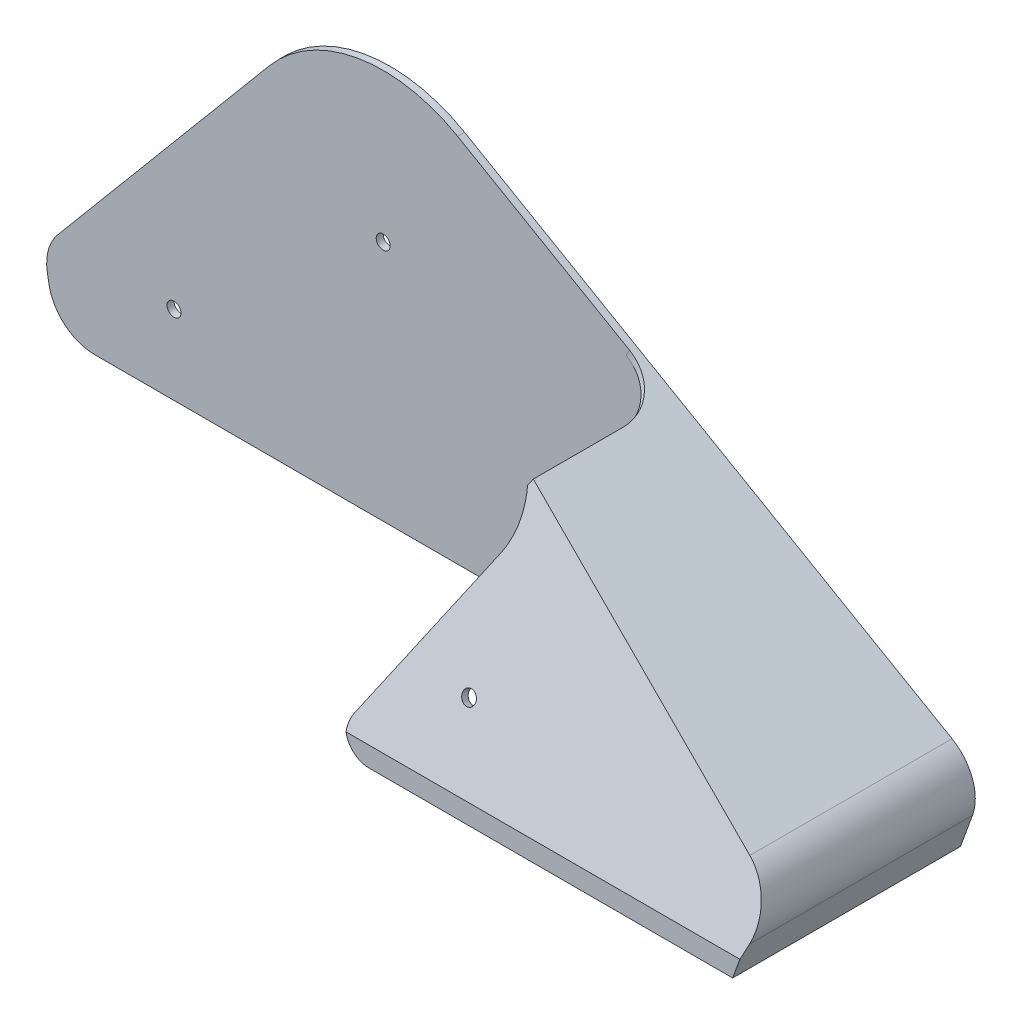
ISO-10303-21;
HEADER;
FILE_DESCRIPTION(('STEP AP214'),'2;1');
FILE_NAME('part.step','',(''),(''),'','','');
FILE_SCHEMA(('AUTOMOTIVE_DESIGN { 1 0 10303 214 1 1 1 1 }'));
ENDSEC;
DATA;
#1=APPLICATION_CONTEXT('core data for automotive mechanical design processes');
#2=APPLICATION_PROTOCOL_DEFINITION('international standard','automotive_design',2000,#1);
#3=PRODUCT_CONTEXT('',#1,'mechanical');
#4=PRODUCT('Part','Part','',(#3));
#5=PRODUCT_RELATED_PRODUCT_CATEGORY('part','',(#4));
#6=PRODUCT_DEFINITION_FORMATION('','',#4);
#7=PRODUCT_DEFINITION_CONTEXT('part definition',#1,'design');
#8=PRODUCT_DEFINITION('design','',#6,#7);
#9=PRODUCT_DEFINITION_SHAPE('','',#8);
#10=(LENGTH_UNIT() NAMED_UNIT(*) SI_UNIT(.MILLI.,.METRE.));
#11=(NAMED_UNIT(*) PLANE_ANGLE_UNIT() SI_UNIT($,.RADIAN.));
#12=(NAMED_UNIT(*) SI_UNIT($,.STERADIAN.) SOLID_ANGLE_UNIT());
#13=UNCERTAINTY_MEASURE_WITH_UNIT(LENGTH_MEASURE(1.E-05),#10,'distance_accuracy_value','');
#14=(GEOMETRIC_REPRESENTATION_CONTEXT(3) GLOBAL_UNCERTAINTY_ASSIGNED_CONTEXT((#13)) GLOBAL_UNIT_ASSIGNED_CONTEXT((#10,
#11,#12)) REPRESENTATION_CONTEXT('',''));
#15=CARTESIAN_POINT('',(0.,0.,0.));
#16=DIRECTION('',(0.,0.,1.));
#17=DIRECTION('',(1.,0.,0.));
#18=AXIS2_PLACEMENT_3D('',#15,#16,#17);
#19=CARTESIAN_POINT('',(-41.9752973417695,-243.681845607916,46.));
#20=DIRECTION('',(0.,1.,0.));
#21=DIRECTION('',(0.,0.,1.));
#22=AXIS2_PLACEMENT_3D('',#19,#20,#21);
#23=PLANE('',#22);
#24=DIRECTION('',(1.,0.,0.));
#25=VECTOR('',#24,1.);
#26=CARTESIAN_POINT('',(-41.9752973417695,-243.681845607916,47.5));
#27=LINE('',#26,#25);
#28=CARTESIAN_POINT('',(-118.598691665262,-243.681845607916,47.5));
#29=VERTEX_POINT('',#28);
#30=CARTESIAN_POINT('',(-40.3790306830556,-243.681845607916,47.5));
#31=VERTEX_POINT('',#30);
#32=EDGE_CURVE('E212',#29,#31,#27,.T.);
#33=ORIENTED_EDGE('',*,*,#32,.F.);
#34=DIRECTION('',(0.,0.,-1.));
#35=VECTOR('',#34,1.);
#36=CARTESIAN_POINT('',(-118.598691665262,-243.681845607916,46.));
#37=LINE('',#36,#35);
#38=CARTESIAN_POINT('',(-118.598691665262,-243.681845607916,46.));
#39=VERTEX_POINT('',#38);
#40=EDGE_CURVE('E269',#29,#39,#37,.T.);
#41=ORIENTED_EDGE('',*,*,#40,.T.);
#42=DIRECTION('',(1.,0.,0.));
#43=VECTOR('',#42,1.);
#44=CARTESIAN_POINT('',(-41.9752973417695,-243.681845607916,46.));
#45=LINE('',#44,#43);
#46=CARTESIAN_POINT('',(-41.9752973417695,-243.681845607916,46.));
#47=VERTEX_POINT('',#46);
#48=EDGE_CURVE('E322',#39,#47,#45,.T.);
#49=ORIENTED_EDGE('',*,*,#48,.T.);
#50=DIRECTION('',(0.,0.,-1.));
#51=VECTOR('',#50,1.);
#52=CARTESIAN_POINT('',(-41.9752973417695,-243.681845607916,46.));
#53=LINE('',#52,#51);
#54=CARTESIAN_POINT('',(-41.9752973417695,-243.681845607916,0.));
#55=VERTEX_POINT('',#54);
#56=EDGE_CURVE('E200',#47,#55,#53,.T.);
#57=ORIENTED_EDGE('',*,*,#56,.T.);
#58=DIRECTION('',(1.,0.,0.));
#59=VECTOR('',#58,1.);
#60=CARTESIAN_POINT('',(-41.9752973417695,-243.681845607916,0.));
#61=LINE('',#60,#59);
#62=CARTESIAN_POINT('',(-225.107440947825,-243.681845607916,0.));
#63=VERTEX_POINT('',#62);
#64=EDGE_CURVE('E312',#63,#55,#61,.T.);
#65=ORIENTED_EDGE('',*,*,#64,.F.);
#66=DIRECTION('',(0.,0.,-1.));
#67=VECTOR('',#66,1.);
#68=CARTESIAN_POINT('',(-225.107440947825,-243.681845607916,46.));
#69=LINE('',#68,#67);
#70=CARTESIAN_POINT('',(-225.107440947825,-243.681845607916,-1.5));
#71=VERTEX_POINT('',#70);
#72=EDGE_CURVE('E251',#63,#71,#69,.T.);
#73=ORIENTED_EDGE('',*,*,#72,.T.);
#74=DIRECTION('',(1.,0.,0.));
#75=VECTOR('',#74,1.);
#76=CARTESIAN_POINT('',(-41.9752973417695,-243.681845607916,-1.5));
#77=LINE('',#76,#75);
#78=CARTESIAN_POINT('',(-40.3790306830556,-243.681845607916,-1.5));
#79=VERTEX_POINT('',#78);
#80=EDGE_CURVE('E217',#71,#79,#77,.T.);
#81=ORIENTED_EDGE('',*,*,#80,.T.);
#82=DIRECTION('',(0.,0.,-1.));
#83=VECTOR('',#82,1.);
#84=CARTESIAN_POINT('',(-40.3790306830556,-243.681845607916,46.));
#85=LINE('',#84,#83);
#86=EDGE_CURVE('E222',#31,#79,#85,.T.);
#87=ORIENTED_EDGE('',*,*,#86,.F.);
#88=EDGE_LOOP('',(#33,#41,#49,#57,#65,#73,#81,#87));
#89=FACE_BOUND('',#88,.T.);
#90=ADVANCED_FACE('F38',(#89),#23,.F.);
#91=CARTESIAN_POINT('',(-163.054662392863,-191.681845607916,47.5));
#92=DIRECTION('',(0.,0.,1.));
#93=DIRECTION('',(1.,0.,0.));
#94=AXIS2_PLACEMENT_3D('',#91,#92,#93);
#95=PLANE('',#94);
#96=DIRECTION('',(-1.,0.,0.));
#97=VECTOR('',#96,1.);
#98=CARTESIAN_POINT('',(-163.054662392863,-239.413539783714,47.5));
#99=LINE('',#98,#97);
#100=CARTESIAN_POINT('',(-38.825494412301,-239.413539783714,47.5));
#101=VERTEX_POINT('',#100);
#102=CARTESIAN_POINT('',(-123.544864289939,-239.413539783714,47.5));
#103=VERTEX_POINT('',#102);
#104=EDGE_CURVE('E202',#101,#103,#99,.T.);
#105=ORIENTED_EDGE('',*,*,#104,.T.);
#106=CARTESIAN_POINT('',(-118.598691665262,-238.681845607916,47.5));
#107=DIRECTION('',(0.,0.,1.));
#108=DIRECTION('',(1.,0.,0.));
#109=AXIS2_PLACEMENT_3D('',#106,#107,#108);
#110=CIRCLE('',#109,5.);
#111=EDGE_CURVE('E280',#103,#29,#110,.T.);
#112=ORIENTED_EDGE('',*,*,#111,.T.);
#113=ORIENTED_EDGE('',*,*,#32,.T.);
#114=DIRECTION('',(0.342020143325666,0.939692620785909,0.));
#115=VECTOR('',#114,1.);
#116=CARTESIAN_POINT('',(-35.358522416334,-229.888112510913,47.5));
#117=LINE('',#116,#115);
#118=EDGE_CURVE('E219',#31,#101,#117,.T.);
#119=ORIENTED_EDGE('',*,*,#118,.T.);
#120=EDGE_LOOP('',(#105,#112,#113,#119));
#121=FACE_BOUND('',#120,.T.);
#122=ADVANCED_FACE('F429',(#121),#95,.T.);
#123=CARTESIAN_POINT('',(-163.054662392863,-191.681845607916,46.));
#124=DIRECTION('',(0.,0.,-1.));
#125=DIRECTION('',(-1.,0.,0.));
#126=AXIS2_PLACEMENT_3D('',#123,#124,#125);
#127=CYLINDRICAL_SURFACE('',#126,32.);
#128=CARTESIAN_POINT('',(-163.054662392863,-191.681845607916,0.));
#129=DIRECTION('',(0.,0.,1.));
#130=DIRECTION('',(1.,0.,0.));
#131=AXIS2_PLACEMENT_3D('',#128,#129,#130);
#132=CIRCLE('',#131,32.);
#133=CARTESIAN_POINT('',(-147.054662392863,-163.969032686814,0.));
#134=VERTEX_POINT('',#133);
#135=CARTESIAN_POINT('',(-187.56808457267,-171.112642097946,0.));
#136=VERTEX_POINT('',#135);
#137=EDGE_CURVE('E346',#134,#136,#132,.T.);
#138=ORIENTED_EDGE('',*,*,#137,.F.);
#139=DIRECTION('',(0.,0.,-1.));
#140=VECTOR('',#139,1.);
#141=CARTESIAN_POINT('',(-147.054662392863,-163.969032686814,46.));
#142=LINE('',#141,#140);
#143=CARTESIAN_POINT('',(-147.054662392863,-163.969032686814,-1.5));
#144=VERTEX_POINT('',#143);
#145=EDGE_CURVE('E226',#134,#144,#142,.T.);
#146=ORIENTED_EDGE('',*,*,#145,.T.);
#147=CARTESIAN_POINT('',(-163.054662392863,-191.681845607916,-1.5));
#148=DIRECTION('',(0.,0.,1.));
#149=DIRECTION('',(1.,0.,0.));
#150=AXIS2_PLACEMENT_3D('',#147,#148,#149);
#151=CIRCLE('',#150,32.);
#152=CARTESIAN_POINT('',(-187.56808457267,-171.112642097946,-1.5));
#153=VERTEX_POINT('',#152);
#154=EDGE_CURVE('E209',#144,#153,#151,.T.);
#155=ORIENTED_EDGE('',*,*,#154,.T.);
#156=DIRECTION('',(0.,0.,1.));
#157=VECTOR('',#156,1.);
#158=CARTESIAN_POINT('',(-187.56808457267,-171.112642097946,46.));
#159=LINE('',#158,#157);
#160=EDGE_CURVE('E225',#136,#153,#159,.F.);
#161=ORIENTED_EDGE('',*,*,#160,.F.);
#162=EDGE_LOOP('',(#138,#146,#155,#161));
#163=FACE_BOUND('',#162,.T.);
#164=ADVANCED_FACE('F344',(#163),#127,.T.);
#165=CARTESIAN_POINT('',(-187.56808457267,-171.112642097946,46.));
#166=DIRECTION('',(0.766044443118977,-0.642787609686541,0.));
#167=DIRECTION('',(0.642787609686541,0.766044443118977,0.));
#168=AXIS2_PLACEMENT_3D('',#165,#166,#167);
#169=PLANE('',#168);
#170=DIRECTION('',(-0.642787609686541,-0.766044443118977,0.));
#171=VECTOR('',#170,1.);
#172=CARTESIAN_POINT('',(-187.56808457267,-171.112642097946,-1.5));
#173=LINE('',#172,#171);
#174=CARTESIAN_POINT('',(-233.099269712768,-225.37459556373,-1.5));
#175=VERTEX_POINT('',#174);
#176=EDGE_CURVE('E335',#153,#175,#173,.T.);
#177=ORIENTED_EDGE('',*,*,#176,.T.);
#178=DIRECTION('',(0.,0.,-1.));
#179=VECTOR('',#178,1.);
#180=CARTESIAN_POINT('',(-233.099269712768,-225.37459556373,46.));
#181=LINE('',#180,#179);
#182=CARTESIAN_POINT('',(-233.099269712768,-225.37459556373,0.));
#183=VERTEX_POINT('',#182);
#184=EDGE_CURVE('E267',#175,#183,#181,.F.);
#185=ORIENTED_EDGE('',*,*,#184,.T.);
#186=DIRECTION('',(-0.642787609686541,-0.766044443118977,0.));
#187=VECTOR('',#186,1.);
#188=CARTESIAN_POINT('',(-187.56808457267,-171.112642097946,0.));
#189=LINE('',#188,#187);
#190=EDGE_CURVE('E367',#136,#183,#189,.T.);
#191=ORIENTED_EDGE('',*,*,#190,.F.);
#192=ORIENTED_EDGE('',*,*,#160,.T.);
#193=EDGE_LOOP('',(#177,#185,#191,#192));
#194=FACE_BOUND('',#193,.T.);
#195=ADVANCED_FACE('F356',(#194),#169,.F.);
#196=CARTESIAN_POINT('',(-233.452508971288,-243.942317874416,46.));
#197=DIRECTION('',(0.984807753012209,0.173648177666926,0.));
#198=DIRECTION('',(-0.173648177666926,0.984807753012209,0.));
#199=AXIS2_PLACEMENT_3D('',#196,#197,#198);
#200=PLANE('',#199);
#201=DIRECTION('',(0.173648177666926,-0.984807753012209,0.));
#202=VECTOR('',#201,1.);
#203=CARTESIAN_POINT('',(-233.452508971288,-243.942317874416,-1.5));
#204=LINE('',#203,#202);
#205=CARTESIAN_POINT('',(-235.286902811701,-233.538953437264,-1.5));
#206=VERTEX_POINT('',#205);
#207=CARTESIAN_POINT('',(-234.955518477947,-235.418327384585,-1.5));
#208=VERTEX_POINT('',#207);
#209=EDGE_CURVE('E221',#206,#208,#204,.T.);
#210=ORIENTED_EDGE('',*,*,#209,.T.);
#211=DIRECTION('',(0.,0.,-1.));
#212=VECTOR('',#211,1.);
#213=CARTESIAN_POINT('',(-234.955518477947,-235.418327384585,46.));
#214=LINE('',#213,#212);
#215=CARTESIAN_POINT('',(-234.955518477947,-235.418327384585,0.));
#216=VERTEX_POINT('',#215);
#217=EDGE_CURVE('E261',#208,#216,#214,.F.);
#218=ORIENTED_EDGE('',*,*,#217,.T.);
#219=DIRECTION('',(0.173648177666927,-0.984807753012209,0.));
#220=VECTOR('',#219,1.);
#221=CARTESIAN_POINT('',(-240.266821263985,-205.296432455643,0.));
#222=LINE('',#221,#220);
#223=CARTESIAN_POINT('',(-235.286902811701,-233.538953437264,0.));
#224=VERTEX_POINT('',#223);
#225=EDGE_CURVE('E365',#224,#216,#222,.T.);
#226=ORIENTED_EDGE('',*,*,#225,.F.);
#227=DIRECTION('',(0.,0.,-1.));
#228=VECTOR('',#227,1.);
#229=CARTESIAN_POINT('',(-235.286902811701,-233.538953437264,46.));
#230=LINE('',#229,#228);
#231=EDGE_CURVE('E258',#224,#206,#230,.T.);
#232=ORIENTED_EDGE('',*,*,#231,.T.);
#233=EDGE_LOOP('',(#210,#218,#226,#232));
#234=FACE_BOUND('',#233,.T.);
#235=ADVANCED_FACE('F369',(#234),#200,.F.);
#236=CARTESIAN_POINT('',(-147.054662392863,-163.969032686814,46.));
#237=DIRECTION('',(-0.499999999999998,-0.86602540378444,0.));
#238=DIRECTION('',(0.86602540378444,-0.499999999999998,0.));
#239=AXIS2_PLACEMENT_3D('',#236,#237,#238);
#240=PLANE('',#239);
#241=DIRECTION('',(-0.86602540378444,0.499999999999998,0.));
#242=VECTOR('',#241,1.);
#243=CARTESIAN_POINT('',(-147.054662392863,-163.969032686814,0.));
#244=LINE('',#243,#242);
#245=CARTESIAN_POINT('',(-110.064861814121,-185.325104008221,0.));
#246=VERTEX_POINT('',#245);
#247=EDGE_CURVE('E186',#246,#134,#244,.T.);
#248=ORIENTED_EDGE('',*,*,#247,.F.);
#249=CARTESIAN_POINT('',(-110.064861814121,-185.325104008221,10.));
#250=DIRECTION('',(-0.499999999999998,-0.86602540378444,0.));
#251=DIRECTION('',(0.86602540378444,-0.499999999999998,0.));
#252=AXIS2_PLACEMENT_3D('',#249,#250,#251);
#253=CIRCLE('',#252,10.);
#254=CARTESIAN_POINT('',(-101.404607776277,-190.325104008221,10.));
#255=VERTEX_POINT('',#254);
#256=EDGE_CURVE('E47',#246,#255,#253,.T.);
#257=ORIENTED_EDGE('',*,*,#256,.T.);
#258=DIRECTION('',(0.,0.,-1.));
#259=VECTOR('',#258,1.);
#260=CARTESIAN_POINT('',(-101.404607776277,-190.325104008221,34.8107421787631));
#261=LINE('',#260,#259);
#262=CARTESIAN_POINT('',(-101.404607776277,-190.325104008221,29.3586215612309));
#263=VERTEX_POINT('',#262);
#264=EDGE_CURVE('E180',#263,#255,#261,.T.);
#265=ORIENTED_EDGE('',*,*,#264,.F.);
#266=DIRECTION('',(-0.851608514271017,0.491676404958546,-0.18170649748468));
#267=VECTOR('',#266,1.);
#268=CARTESIAN_POINT('',(-142.972289569604,-166.325991735255,20.4893844168738));
#269=LINE('',#268,#267);
#270=CARTESIAN_POINT('',(-42.1948549212111,-224.509870757744,41.9921223164894));
#271=VERTEX_POINT('',#270);
#272=EDGE_CURVE('E191',#271,#263,#269,.T.);
#273=ORIENTED_EDGE('',*,*,#272,.F.);
#274=DIRECTION('',(0.,0.,-1.));
#275=VECTOR('',#274,1.);
#276=CARTESIAN_POINT('',(-42.1948549212111,-224.509870757744,46.));
#277=LINE('',#276,#275);
#278=CARTESIAN_POINT('',(-42.1948549212111,-224.509870757744,-1.5));
#279=VERTEX_POINT('',#278);
#280=EDGE_CURVE('E244',#271,#279,#277,.T.);
#281=ORIENTED_EDGE('',*,*,#280,.T.);
#282=DIRECTION('',(-0.86602540378444,0.499999999999998,0.));
#283=VECTOR('',#282,1.);
#284=CARTESIAN_POINT('',(-147.054662392863,-163.969032686814,-1.5));
#285=LINE('',#284,#283);
#286=EDGE_CURVE('E211',#279,#144,#285,.T.);
#287=ORIENTED_EDGE('',*,*,#286,.T.);
#288=ORIENTED_EDGE('',*,*,#145,.F.);
#289=EDGE_LOOP('',(#248,#257,#265,#273,#281,#287,#288));
#290=FACE_BOUND('',#289,.T.);
#291=ADVANCED_FACE('F189',(#290),#240,.F.);
#292=CARTESIAN_POINT('',(0.,-13.3245376288953,-36.0546312311286));
#293=DIRECTION('',(0.,0.346650140871629,0.937994498829113));
#294=DIRECTION('',(0.,-0.937994498829113,0.346650140871629));
#295=AXIS2_PLACEMENT_3D('',#292,#293,#294);
#296=PLANE('',#295);
#297=CARTESIAN_POINT('',(-102.379030683056,-225.091952914172,42.2072396351692));
#298=DIRECTION('',(0.,0.346650140871629,0.937994498829113));
#299=DIRECTION('',(0.,-0.937994498829113,0.346650140871629));
#300=AXIS2_PLACEMENT_3D('',#297,#298,#299);
#301=CIRCLE('',#300,1.5);
#302=CARTESIAN_POINT('',(-102.379030683056,-226.498944662415,42.7272148464767));
#303=VERTEX_POINT('',#302);
#304=EDGE_CURVE('E412',#303,#303,#301,.T.);
#305=ORIENTED_EDGE('',*,*,#304,.F.);
#306=EDGE_LOOP('',(#305));
#307=FACE_BOUND('',#306,.T.);
#308=DIRECTION('',(0.476204765262695,0.824810848241403,-0.304821400437041));
#309=VECTOR('',#308,1.);
#310=CARTESIAN_POINT('',(0.608312315265829,-13.6335433812033,-35.9404334531017));
#311=LINE('',#310,#309);
#312=CARTESIAN_POINT('',(-102.154607776277,-191.624142113897,29.8387008611548));
#313=VERTEX_POINT('',#312);
#314=EDGE_CURVE('E178',#313,#263,#311,.T.);
#315=ORIENTED_EDGE('',*,*,#314,.F.);
#316=CARTESIAN_POINT('',(-116.681595433917,-195.361337532227,31.2198382983636));
#317=DIRECTION('',(0.,0.346650140871629,0.937994498829113));
#318=DIRECTION('',(0.,0.937994498829113,-0.346650140871629));
#319=AXIS2_PLACEMENT_3D('',#316,#317,#318);
#320=ELLIPSE('',#319,15.9915650024859,15.);
#321=CARTESIAN_POINT('',(-103.69121437715,-202.861337532227,33.9915774287983));
#322=VERTEX_POINT('',#321);
#323=EDGE_CURVE('E380',#313,#322,#320,.F.);
#324=ORIENTED_EDGE('',*,*,#323,.T.);
#325=DIRECTION('',(-0.476204765262695,-0.824810848241403,0.304821400437041));
#326=VECTOR('',#325,1.);
#327=CARTESIAN_POINT('',(4.4367170414046,-15.5782665979658,-35.221731394733));
#328=LINE('',#327,#326);
#329=CARTESIAN_POINT('',(-122.928818684184,-236.181845607916,46.305678239379));
#330=VERTEX_POINT('',#329);
#331=EDGE_CURVE('E382',#322,#330,#328,.T.);
#332=ORIENTED_EDGE('',*,*,#331,.T.);
#333=CARTESIAN_POINT('',(-118.598691665262,-238.681845607916,47.2295912828573));
#334=DIRECTION('',(0.,0.346650140871629,0.937994498829113));
#335=DIRECTION('',(0.,-0.937994498829113,0.346650140871629));
#336=AXIS2_PLACEMENT_3D('',#333,#334,#335);
#337=ELLIPSE('',#336,5.33052166749532,5.);
#338=EDGE_CURVE('E278',#330,#103,#337,.T.);
#339=ORIENTED_EDGE('',*,*,#338,.T.);
#340=ORIENTED_EDGE('',*,*,#104,.F.);
#341=DIRECTION('',(0.323091866740261,0.887687608278315,-0.328058463928943));
#342=VECTOR('',#341,1.);
#343=CARTESIAN_POINT('',(-35.5726565776119,-230.476441283757,44.1971592500162));
#344=LINE('',#343,#342);
#345=CARTESIAN_POINT('',(-37.797928713352,-236.590326228845,46.4566384688529));
#346=VERTEX_POINT('',#345);
#347=EDGE_CURVE('E199',#101,#346,#344,.T.);
#348=ORIENTED_EDGE('',*,*,#347,.T.);
#349=CARTESIAN_POINT('',(-47.1948549212111,-233.170124795588,45.1926509826494));
#350=DIRECTION('',(0.,0.346650140871629,0.937994498829113));
#351=DIRECTION('',(0.,0.937994498829113,-0.346650140871629));
#352=AXIS2_PLACEMENT_3D('',#349,#350,#351);
#353=ELLIPSE('',#352,10.6610433349906,10.);
#354=EDGE_CURVE('E198',#346,#271,#353,.T.);
#355=ORIENTED_EDGE('',*,*,#354,.T.);
#356=ORIENTED_EDGE('',*,*,#272,.T.);
#357=EDGE_LOOP('',(#315,#324,#332,#339,#340,#348,#355,#356));
#358=FACE_BOUND('',#357,.T.);
#359=ADVANCED_FACE('F195',(#307,#358),#296,.T.);
#360=CARTESIAN_POINT('',(-163.054662392863,-191.681845607916,46.));
#361=DIRECTION('',(0.,0.,1.));
#362=DIRECTION('',(1.,0.,0.));
#363=AXIS2_PLACEMENT_3D('',#360,#361,#362);
#364=PLANE('',#363);
#365=ORIENTED_EDGE('',*,*,#48,.F.);
#366=CARTESIAN_POINT('',(-118.598691665262,-238.681845607916,46.));
#367=DIRECTION('',(0.,0.,1.));
#368=DIRECTION('',(1.,0.,0.));
#369=AXIS2_PLACEMENT_3D('',#366,#367,#368);
#370=CIRCLE('',#369,5.);
#371=CARTESIAN_POINT('',(-123.497671150828,-239.681845607916,46.));
#372=VERTEX_POINT('',#371);
#373=EDGE_CURVE('E272',#39,#372,#370,.F.);
#374=ORIENTED_EDGE('',*,*,#373,.T.);
#375=DIRECTION('',(-1.,0.,0.));
#376=VECTOR('',#375,1.);
#377=CARTESIAN_POINT('',(-163.054662392863,-239.681845607916,46.));
#378=LINE('',#377,#376);
#379=CARTESIAN_POINT('',(-40.5194164047047,-239.681845607916,46.));
#380=VERTEX_POINT('',#379);
#381=EDGE_CURVE('E313',#380,#372,#378,.T.);
#382=ORIENTED_EDGE('',*,*,#381,.F.);
#383=DIRECTION('',(0.342020143325666,0.939692620785909,0.));
#384=VECTOR('',#383,1.);
#385=CARTESIAN_POINT('',(-36.7680613475128,-229.375082295924,46.));
#386=LINE('',#385,#384);
#387=EDGE_CURVE('E205',#47,#380,#386,.T.);
#388=ORIENTED_EDGE('',*,*,#387,.F.);
#389=EDGE_LOOP('',(#365,#374,#382,#388));
#390=FACE_BOUND('',#389,.T.);
#391=ADVANCED_FACE('F459',(#390),#364,.F.);
#392=CARTESIAN_POINT('',(-147.804662392863,-165.26807079249,46.));
#393=DIRECTION('',(-0.499999999999998,-0.86602540378444,0.));
#394=DIRECTION('',(0.86602540378444,-0.499999999999998,0.));
#395=AXIS2_PLACEMENT_3D('',#392,#393,#394);
#396=PLANE('',#395);
#397=DIRECTION('',(-0.86602540378444,0.499999999999998,0.));
#398=VECTOR('',#397,1.);
#399=CARTESIAN_POINT('',(-147.804662392863,-165.26807079249,0.));
#400=LINE('',#399,#398);
#401=CARTESIAN_POINT('',(-44.0348773165696,-225.179584140038,0.));
#402=VERTEX_POINT('',#401);
#403=CARTESIAN_POINT('',(-110.814861814121,-186.624142113897,0.));
#404=VERTEX_POINT('',#403);
#405=EDGE_CURVE('E307',#402,#404,#400,.T.);
#406=ORIENTED_EDGE('',*,*,#405,.F.);
#407=DIRECTION('',(0.,0.,-1.));
#408=VECTOR('',#407,1.);
#409=CARTESIAN_POINT('',(-44.0348773165696,-225.179584140038,42.1909787760031));
#410=LINE('',#409,#408);
#411=CARTESIAN_POINT('',(-44.0348773165697,-225.179584140038,40.6404685879581));
#412=VERTEX_POINT('',#411);
#413=EDGE_CURVE('E240',#402,#412,#410,.F.);
#414=ORIENTED_EDGE('',*,*,#413,.T.);
#415=DIRECTION('',(-0.851608514271017,0.491676404958546,-0.18170649748468));
#416=VECTOR('',#415,1.);
#417=CARTESIAN_POINT('',(-143.549120429811,-167.725009090406,19.407256069616));
#418=LINE('',#417,#416);
#419=CARTESIAN_POINT('',(-102.154607776277,-191.624142113897,28.2395443609062));
#420=VERTEX_POINT('',#419);
#421=EDGE_CURVE('E385',#412,#420,#418,.T.);
#422=ORIENTED_EDGE('',*,*,#421,.T.);
#423=DIRECTION('',(0.,0.,-1.));
#424=VECTOR('',#423,1.);
#425=CARTESIAN_POINT('',(-102.154607776277,-191.624142113897,47.5));
#426=LINE('',#425,#424);
#427=CARTESIAN_POINT('',(-102.154607776277,-191.624142113897,10.));
#428=VERTEX_POINT('',#427);
#429=EDGE_CURVE('E374',#420,#428,#426,.T.);
#430=ORIENTED_EDGE('',*,*,#429,.T.);
#431=CARTESIAN_POINT('',(-110.814861814121,-186.624142113897,10.));
#432=DIRECTION('',(-0.499999999999998,-0.86602540378444,0.));
#433=DIRECTION('',(0.86602540378444,-0.499999999999998,0.));
#434=AXIS2_PLACEMENT_3D('',#431,#432,#433);
#435=CIRCLE('',#434,10.);
#436=EDGE_CURVE('E11',#428,#404,#435,.F.);
#437=ORIENTED_EDGE('',*,*,#436,.T.);
#438=EDGE_LOOP('',(#406,#414,#422,#430,#437));
#439=FACE_BOUND('',#438,.T.);
#440=ADVANCED_FACE('F400',(#439),#396,.T.);
#441=CARTESIAN_POINT('',(-163.054662392863,-191.681845607916,46.));
#442=DIRECTION('',(0.,0.,-1.));
#443=DIRECTION('',(-1.,0.,0.));
#444=AXIS2_PLACEMENT_3D('',#441,#442,#443);
#445=CYLINDRICAL_SURFACE('',#444,1.5);
#446=CARTESIAN_POINT('',(-163.054662392863,-191.681845607916,-1.5));
#447=DIRECTION('',(0.,0.,1.));
#448=DIRECTION('',(1.,0.,0.));
#449=AXIS2_PLACEMENT_3D('',#446,#447,#448);
#450=CIRCLE('',#449,1.5);
#451=CARTESIAN_POINT('',(-161.554662392863,-191.681845607916,-1.5));
#452=VERTEX_POINT('',#451);
#453=EDGE_CURVE('E227',#452,#452,#450,.T.);
#454=ORIENTED_EDGE('',*,*,#453,.F.);
#455=EDGE_LOOP('',(#454));
#456=FACE_BOUND('',#455,.T.);
#457=CARTESIAN_POINT('',(-163.054662392863,-191.681845607916,0.));
#458=DIRECTION('',(0.,0.,1.));
#459=DIRECTION('',(1.,0.,0.));
#460=AXIS2_PLACEMENT_3D('',#457,#458,#459);
#461=CIRCLE('',#460,1.5);
#462=CARTESIAN_POINT('',(-161.554662392863,-191.681845607916,0.));
#463=VERTEX_POINT('',#462);
#464=EDGE_CURVE('E310',#463,#463,#461,.T.);
#465=ORIENTED_EDGE('',*,*,#464,.T.);
#466=EDGE_LOOP('',(#465));
#467=FACE_BOUND('',#466,.T.);
#468=ADVANCED_FACE('F439',(#456,#467),#445,.F.);
#469=CARTESIAN_POINT('',(-35.358522416334,-229.888112510913,46.));
#470=DIRECTION('',(-0.939692620785909,0.342020143325666,0.));
#471=DIRECTION('',(-0.342020143325666,-0.939692620785909,0.));
#472=AXIS2_PLACEMENT_3D('',#469,#470,#471);
#473=PLANE('',#472);
#474=DIRECTION('',(0.342020143325666,0.939692620785909,0.));
#475=VECTOR('',#474,1.);
#476=CARTESIAN_POINT('',(-35.358522416334,-229.888112510913,-1.5));
#477=LINE('',#476,#475);
#478=CARTESIAN_POINT('',(-37.797928713352,-236.590326228845,-1.5));
#479=VERTEX_POINT('',#478);
#480=EDGE_CURVE('E213',#79,#479,#477,.T.);
#481=ORIENTED_EDGE('',*,*,#480,.T.);
#482=DIRECTION('',(0.,0.,-1.));
#483=VECTOR('',#482,1.);
#484=CARTESIAN_POINT('',(-37.797928713352,-236.590326228845,46.));
#485=LINE('',#484,#483);
#486=EDGE_CURVE('E248',#479,#346,#485,.F.);
#487=ORIENTED_EDGE('',*,*,#486,.T.);
#488=ORIENTED_EDGE('',*,*,#347,.F.);
#489=ORIENTED_EDGE('',*,*,#118,.F.);
#490=ORIENTED_EDGE('',*,*,#86,.T.);
#491=EDGE_LOOP('',(#481,#487,#488,#489,#490));
#492=FACE_BOUND('',#491,.T.);
#493=ADVANCED_FACE('F448',(#492),#473,.F.);
#494=CARTESIAN_POINT('',(-163.054662392863,-191.681845607916,-1.5));
#495=DIRECTION('',(0.,0.,1.));
#496=DIRECTION('',(1.,0.,0.));
#497=AXIS2_PLACEMENT_3D('',#494,#495,#496);
#498=PLANE('',#497);
#499=CARTESIAN_POINT('',(-208.054662392863,-226.681845607916,-1.5));
#500=DIRECTION('',(0.,0.,-1.));
#501=DIRECTION('',(-1.,0.,0.));
#502=AXIS2_PLACEMENT_3D('',#499,#500,#501);
#503=CIRCLE('',#502,1.5);
#504=CARTESIAN_POINT('',(-209.554662392863,-226.681845607916,-1.5));
#505=VERTEX_POINT('',#504);
#506=EDGE_CURVE('E290',#505,#505,#503,.T.);
#507=ORIENTED_EDGE('',*,*,#506,.F.);
#508=EDGE_LOOP('',(#507));
#509=FACE_BOUND('',#508,.T.);
#510=CARTESIAN_POINT('',(-63.0546623928632,-226.681845607916,-1.5));
#511=DIRECTION('',(0.,0.,-1.));
#512=DIRECTION('',(-1.,0.,0.));
#513=AXIS2_PLACEMENT_3D('',#510,#511,#512);
#514=CIRCLE('',#513,1.5);
#515=CARTESIAN_POINT('',(-64.5546623928632,-226.681845607916,-1.5));
#516=VERTEX_POINT('',#515);
#517=EDGE_CURVE('E407',#516,#516,#514,.T.);
#518=ORIENTED_EDGE('',*,*,#517,.F.);
#519=EDGE_LOOP('',(#518));
#520=FACE_BOUND('',#519,.T.);
#521=ORIENTED_EDGE('',*,*,#80,.F.);
#522=CARTESIAN_POINT('',(-225.107440947825,-233.681845607916,-1.5));
#523=DIRECTION('',(0.,0.,1.));
#524=DIRECTION('',(1.,0.,0.));
#525=AXIS2_PLACEMENT_3D('',#522,#523,#524);
#526=CIRCLE('',#525,10.);
#527=EDGE_CURVE('E256',#71,#208,#526,.F.);
#528=ORIENTED_EDGE('',*,*,#527,.T.);
#529=ORIENTED_EDGE('',*,*,#209,.F.);
#530=CARTESIAN_POINT('',(-225.438825281578,-231.802471660595,-1.5));
#531=DIRECTION('',(0.,0.,1.));
#532=DIRECTION('',(1.,0.,0.));
#533=AXIS2_PLACEMENT_3D('',#530,#531,#532);
#534=CIRCLE('',#533,10.);
#535=EDGE_CURVE('E254',#206,#175,#534,.F.);
#536=ORIENTED_EDGE('',*,*,#535,.T.);
#537=ORIENTED_EDGE('',*,*,#176,.F.);
#538=ORIENTED_EDGE('',*,*,#154,.F.);
#539=ORIENTED_EDGE('',*,*,#286,.F.);
#540=CARTESIAN_POINT('',(-47.1948549212111,-233.170124795588,-1.5));
#541=DIRECTION('',(0.,0.,1.));
#542=DIRECTION('',(1.,0.,0.));
#543=AXIS2_PLACEMENT_3D('',#540,#541,#542);
#544=CIRCLE('',#543,10.);
#545=EDGE_CURVE('E246',#279,#479,#544,.F.);
#546=ORIENTED_EDGE('',*,*,#545,.T.);
#547=ORIENTED_EDGE('',*,*,#480,.F.);
#548=EDGE_LOOP('',(#521,#528,#529,#536,#537,#538,#539,#546,#547));
#549=FACE_BOUND('',#548,.T.);
#550=ORIENTED_EDGE('',*,*,#453,.T.);
#551=EDGE_LOOP('',(#550));
#552=FACE_BOUND('',#551,.T.);
#553=ADVANCED_FACE('F351',(#509,#520,#549,#552),#498,.F.);
#554=CARTESIAN_POINT('',(-36.7680613475128,-229.375082295924,46.));
#555=DIRECTION('',(-0.939692620785909,0.342020143325666,0.));
#556=DIRECTION('',(-0.342020143325666,-0.939692620785909,0.));
#557=AXIS2_PLACEMENT_3D('',#554,#555,#556);
#558=PLANE('',#557);
#559=DIRECTION('',(0.323091866740261,0.887687608278315,-0.328058463928943));
#560=VECTOR('',#559,1.);
#561=CARTESIAN_POINT('',(-37.1717910160428,-230.484320443774,42.600914613252));
#562=LINE('',#561,#560);
#563=CARTESIAN_POINT('',(-39.6379511087105,-237.260039611139,45.1049847403215));
#564=VERTEX_POINT('',#563);
#565=EDGE_CURVE('E318',#380,#564,#562,.T.);
#566=ORIENTED_EDGE('',*,*,#565,.T.);
#567=DIRECTION('',(0.,0.,-1.));
#568=VECTOR('',#567,1.);
#569=CARTESIAN_POINT('',(-39.6379511087105,-237.260039611139,0.));
#570=LINE('',#569,#568);
#571=CARTESIAN_POINT('',(-39.6379511087105,-237.260039611139,0.));
#572=VERTEX_POINT('',#571);
#573=EDGE_CURVE('E235',#564,#572,#570,.T.);
#574=ORIENTED_EDGE('',*,*,#573,.T.);
#575=DIRECTION('',(0.342020143325666,0.939692620785909,0.));
#576=VECTOR('',#575,1.);
#577=CARTESIAN_POINT('',(-36.7680613475128,-229.375082295924,0.));
#578=LINE('',#577,#576);
#579=EDGE_CURVE('E315',#55,#572,#578,.T.);
#580=ORIENTED_EDGE('',*,*,#579,.F.);
#581=ORIENTED_EDGE('',*,*,#56,.F.);
#582=ORIENTED_EDGE('',*,*,#387,.T.);
#583=EDGE_LOOP('',(#566,#574,#580,#581,#582));
#584=FACE_BOUND('',#583,.T.);
#585=ADVANCED_FACE('F301',(#584),#558,.T.);
#586=CARTESIAN_POINT('',(-163.054662392863,-191.681845607916,0.));
#587=DIRECTION('',(0.,0.,1.));
#588=DIRECTION('',(1.,0.,0.));
#589=AXIS2_PLACEMENT_3D('',#586,#587,#588);
#590=PLANE('',#589);
#591=CARTESIAN_POINT('',(-208.054662392863,-226.681845607916,0.));
#592=DIRECTION('',(0.,0.,1.));
#593=DIRECTION('',(1.,0.,0.));
#594=AXIS2_PLACEMENT_3D('',#591,#592,#593);
#595=CIRCLE('',#594,1.5);
#596=CARTESIAN_POINT('',(-206.554662392863,-226.681845607916,0.));
#597=VERTEX_POINT('',#596);
#598=EDGE_CURVE('E193',#597,#597,#595,.T.);
#599=ORIENTED_EDGE('',*,*,#598,.F.);
#600=EDGE_LOOP('',(#599));
#601=FACE_BOUND('',#600,.T.);
#602=CARTESIAN_POINT('',(-63.0546623928632,-226.681845607916,0.));
#603=DIRECTION('',(0.,0.,1.));
#604=DIRECTION('',(1.,0.,0.));
#605=AXIS2_PLACEMENT_3D('',#602,#603,#604);
#606=CIRCLE('',#605,1.5);
#607=CARTESIAN_POINT('',(-61.5546623928632,-226.681845607916,0.));
#608=VERTEX_POINT('',#607);
#609=EDGE_CURVE('E288',#608,#608,#606,.T.);
#610=ORIENTED_EDGE('',*,*,#609,.F.);
#611=EDGE_LOOP('',(#610));
#612=FACE_BOUND('',#611,.T.);
#613=ORIENTED_EDGE('',*,*,#405,.T.);
#614=DIRECTION('',(0.499999999999998,0.86602540378444,0.));
#615=VECTOR('',#614,1.);
#616=CARTESIAN_POINT('',(-126.064861814121,-213.037916929323,0.));
#617=LINE('',#616,#615);
#618=EDGE_CURVE('E283',#404,#246,#617,.T.);
#619=ORIENTED_EDGE('',*,*,#618,.T.);
#620=ORIENTED_EDGE('',*,*,#247,.T.);
#621=ORIENTED_EDGE('',*,*,#137,.T.);
#622=ORIENTED_EDGE('',*,*,#190,.T.);
#623=CARTESIAN_POINT('',(-225.438825281578,-231.802471660595,0.));
#624=DIRECTION('',(0.,0.,1.));
#625=DIRECTION('',(1.,0.,0.));
#626=AXIS2_PLACEMENT_3D('',#623,#624,#625);
#627=CIRCLE('',#626,10.);
#628=EDGE_CURVE('E263',#183,#224,#627,.T.);
#629=ORIENTED_EDGE('',*,*,#628,.T.);
#630=ORIENTED_EDGE('',*,*,#225,.T.);
#631=CARTESIAN_POINT('',(-225.107440947825,-233.681845607916,0.));
#632=DIRECTION('',(0.,0.,1.));
#633=DIRECTION('',(1.,0.,0.));
#634=AXIS2_PLACEMENT_3D('',#631,#632,#633);
#635=CIRCLE('',#634,10.);
#636=EDGE_CURVE('E265',#216,#63,#635,.T.);
#637=ORIENTED_EDGE('',*,*,#636,.T.);
#638=ORIENTED_EDGE('',*,*,#64,.T.);
#639=ORIENTED_EDGE('',*,*,#579,.T.);
#640=CARTESIAN_POINT('',(-49.0348773165696,-233.839838177882,0.));
#641=DIRECTION('',(0.,0.,1.));
#642=DIRECTION('',(1.,0.,0.));
#643=AXIS2_PLACEMENT_3D('',#640,#641,#642);
#644=CIRCLE('',#643,10.);
#645=EDGE_CURVE('E238',#572,#402,#644,.T.);
#646=ORIENTED_EDGE('',*,*,#645,.T.);
#647=EDGE_LOOP('',(#613,#619,#620,#621,#622,#629,#630,#637,#638,#639,#646));
#648=FACE_BOUND('',#647,.T.);
#649=ORIENTED_EDGE('',*,*,#464,.F.);
#650=EDGE_LOOP('',(#649));
#651=FACE_BOUND('',#650,.T.);
#652=ADVANCED_FACE('F297',(#601,#612,#648,#651),#590,.T.);
#653=CARTESIAN_POINT('',(0.,-13.8445128402028,-37.4616229793722));
#654=DIRECTION('',(0.,0.346650140871629,0.937994498829113));
#655=DIRECTION('',(0.,-0.937994498829113,0.346650140871629));
#656=AXIS2_PLACEMENT_3D('',#653,#654,#655);
#657=PLANE('',#656);
#658=CARTESIAN_POINT('',(-102.379030683056,-225.611928125479,40.8002478869255));
#659=DIRECTION('',(0.,0.346650140871629,0.937994498829113));
#660=DIRECTION('',(0.,-0.937994498829113,0.346650140871629));
#661=AXIS2_PLACEMENT_3D('',#658,#659,#660);
#662=CIRCLE('',#661,1.5);
#663=CARTESIAN_POINT('',(-102.379030683056,-227.018919873723,41.320223098233));
#664=VERTEX_POINT('',#663);
#665=EDGE_CURVE('E42',#664,#664,#662,.T.);
#666=ORIENTED_EDGE('',*,*,#665,.T.);
#667=EDGE_LOOP('',(#666));
#668=FACE_BOUND('',#667,.T.);
#669=ORIENTED_EDGE('',*,*,#381,.T.);
#670=CARTESIAN_POINT('',(-118.598691665262,-238.681845607916,45.6304347826087));
#671=DIRECTION('',(0.,0.346650140871629,0.937994498829113));
#672=DIRECTION('',(0.,-0.937994498829113,0.346650140871629));
#673=AXIS2_PLACEMENT_3D('',#670,#671,#672);
#674=ELLIPSE('',#673,5.33052166749532,5.);
#675=CARTESIAN_POINT('',(-122.928818684184,-236.181845607916,44.7065217391304));
#676=VERTEX_POINT('',#675);
#677=EDGE_CURVE('E274',#372,#676,#674,.F.);
#678=ORIENTED_EDGE('',*,*,#677,.T.);
#679=DIRECTION('',(-0.476204765262695,-0.824810848241403,0.304821400437041));
#680=VECTOR('',#679,1.);
#681=CARTESIAN_POINT('',(4.20458763613085,-15.9803265218306,-36.6723005318141));
#682=LINE('',#681,#680);
#683=CARTESIAN_POINT('',(-103.69121437715,-202.861337532227,32.3924209285497));
#684=VERTEX_POINT('',#683);
#685=EDGE_CURVE('E232',#684,#676,#682,.T.);
#686=ORIENTED_EDGE('',*,*,#685,.F.);
#687=CARTESIAN_POINT('',(-116.681595433917,-195.361337532227,29.620681798115));
#688=DIRECTION('',(0.,0.346650140871629,0.937994498829113));
#689=DIRECTION('',(0.,0.937994498829113,-0.346650140871629));
#690=AXIS2_PLACEMENT_3D('',#687,#688,#689);
#691=ELLIPSE('',#690,15.9915650024859,15.);
#692=EDGE_CURVE('E230',#420,#684,#691,.F.);
#693=ORIENTED_EDGE('',*,*,#692,.F.);
#694=ORIENTED_EDGE('',*,*,#421,.F.);
#695=CARTESIAN_POINT('',(-49.0348773165696,-233.839838177882,43.840997254118));
#696=DIRECTION('',(0.,0.346650140871629,0.937994498829113));
#697=DIRECTION('',(0.,-0.937994498829113,0.346650140871629));
#698=AXIS2_PLACEMENT_3D('',#695,#696,#697);
#699=ELLIPSE('',#698,10.6610433349906,10.);
#700=EDGE_CURVE('E242',#412,#564,#699,.F.);
#701=ORIENTED_EDGE('',*,*,#700,.T.);
#702=ORIENTED_EDGE('',*,*,#565,.F.);
#703=EDGE_LOOP('',(#669,#678,#686,#693,#694,#701,#702));
#704=FACE_BOUND('',#703,.T.);
#705=ADVANCED_FACE('F300',(#668,#704),#657,.F.);
#706=CARTESIAN_POINT('',(-113.69121437715,-220.181845607916,47.5));
#707=DIRECTION('',(-0.86602540378444,0.499999999999998,0.));
#708=DIRECTION('',(-0.499999999999998,-0.86602540378444,0.));
#709=AXIS2_PLACEMENT_3D('',#706,#707,#708);
#710=PLANE('',#709);
#711=ORIENTED_EDGE('',*,*,#685,.T.);
#712=DIRECTION('',(0.,0.,-1.));
#713=VECTOR('',#712,1.);
#714=CARTESIAN_POINT('',(-122.928818684184,-236.181845607916,47.5));
#715=LINE('',#714,#713);
#716=EDGE_CURVE('E276',#676,#330,#715,.F.);
#717=ORIENTED_EDGE('',*,*,#716,.T.);
#718=ORIENTED_EDGE('',*,*,#331,.F.);
#719=DIRECTION('',(0.,0.,-1.));
#720=VECTOR('',#719,1.);
#721=CARTESIAN_POINT('',(-103.69121437715,-202.861337532227,47.5));
#722=LINE('',#721,#720);
#723=EDGE_CURVE('E371',#322,#684,#722,.T.);
#724=ORIENTED_EDGE('',*,*,#723,.T.);
#725=EDGE_LOOP('',(#711,#717,#718,#724));
#726=FACE_BOUND('',#725,.T.);
#727=ADVANCED_FACE('F498',(#726),#710,.T.);
#728=CARTESIAN_POINT('',(-116.681595433917,-195.361337532227,47.5));
#729=DIRECTION('',(0.,0.,-1.));
#730=DIRECTION('',(-1.,0.,0.));
#731=AXIS2_PLACEMENT_3D('',#728,#729,#730);
#732=CYLINDRICAL_SURFACE('',#731,15.);
#733=DIRECTION('',(0.,0.,-1.));
#734=VECTOR('',#733,1.);
#735=CARTESIAN_POINT('',(-102.154607776277,-191.624142113897,47.5));
#736=LINE('',#735,#734);
#737=EDGE_CURVE('E182',#420,#313,#736,.F.);
#738=ORIENTED_EDGE('',*,*,#737,.F.);
#739=ORIENTED_EDGE('',*,*,#692,.T.);
#740=ORIENTED_EDGE('',*,*,#723,.F.);
#741=ORIENTED_EDGE('',*,*,#323,.F.);
#742=EDGE_LOOP('',(#738,#739,#740,#741));
#743=FACE_BOUND('',#742,.T.);
#744=ADVANCED_FACE('F464',(#743),#732,.F.);
#745=CARTESIAN_POINT('',(-49.0348773165696,-233.839838177882,46.));
#746=DIRECTION('',(0.,0.,1.));
#747=DIRECTION('',(1.,0.,0.));
#748=AXIS2_PLACEMENT_3D('',#745,#746,#747);
#749=CYLINDRICAL_SURFACE('',#748,10.);
#750=ORIENTED_EDGE('',*,*,#700,.F.);
#751=ORIENTED_EDGE('',*,*,#413,.F.);
#752=ORIENTED_EDGE('',*,*,#645,.F.);
#753=ORIENTED_EDGE('',*,*,#573,.F.);
#754=EDGE_LOOP('',(#750,#751,#752,#753));
#755=FACE_BOUND('',#754,.T.);
#756=ADVANCED_FACE('F397',(#755),#749,.F.);
#757=CARTESIAN_POINT('',(-47.1948549212111,-233.170124795588,46.));
#758=DIRECTION('',(0.,0.,-1.));
#759=DIRECTION('',(-1.,0.,0.));
#760=AXIS2_PLACEMENT_3D('',#757,#758,#759);
#761=CYLINDRICAL_SURFACE('',#760,10.);
#762=ORIENTED_EDGE('',*,*,#354,.F.);
#763=ORIENTED_EDGE('',*,*,#486,.F.);
#764=ORIENTED_EDGE('',*,*,#545,.F.);
#765=ORIENTED_EDGE('',*,*,#280,.F.);
#766=EDGE_LOOP('',(#762,#763,#764,#765));
#767=FACE_BOUND('',#766,.T.);
#768=ADVANCED_FACE('F463',(#767),#761,.T.);
#769=CARTESIAN_POINT('',(-225.107440947825,-233.681845607916,46.));
#770=DIRECTION('',(0.,0.,-1.));
#771=DIRECTION('',(-1.,0.,0.));
#772=AXIS2_PLACEMENT_3D('',#769,#770,#771);
#773=CYLINDRICAL_SURFACE('',#772,10.);
#774=ORIENTED_EDGE('',*,*,#636,.F.);
#775=ORIENTED_EDGE('',*,*,#217,.F.);
#776=ORIENTED_EDGE('',*,*,#527,.F.);
#777=ORIENTED_EDGE('',*,*,#72,.F.);
#778=EDGE_LOOP('',(#774,#775,#776,#777));
#779=FACE_BOUND('',#778,.T.);
#780=ADVANCED_FACE('F467',(#779),#773,.T.);
#781=CARTESIAN_POINT('',(-225.438825281578,-231.802471660595,46.));
#782=DIRECTION('',(0.,0.,-1.));
#783=DIRECTION('',(-1.,0.,0.));
#784=AXIS2_PLACEMENT_3D('',#781,#782,#783);
#785=CYLINDRICAL_SURFACE('',#784,10.);
#786=ORIENTED_EDGE('',*,*,#628,.F.);
#787=ORIENTED_EDGE('',*,*,#184,.F.);
#788=ORIENTED_EDGE('',*,*,#535,.F.);
#789=ORIENTED_EDGE('',*,*,#231,.F.);
#790=EDGE_LOOP('',(#786,#787,#788,#789));
#791=FACE_BOUND('',#790,.T.);
#792=ADVANCED_FACE('F361',(#791),#785,.T.);
#793=CARTESIAN_POINT('',(-118.598691665262,-238.681845607916,46.));
#794=DIRECTION('',(0.,0.,1.));
#795=DIRECTION('',(1.,0.,0.));
#796=AXIS2_PLACEMENT_3D('',#793,#794,#795);
#797=CYLINDRICAL_SURFACE('',#796,5.);
#798=ORIENTED_EDGE('',*,*,#338,.F.);
#799=ORIENTED_EDGE('',*,*,#716,.F.);
#800=ORIENTED_EDGE('',*,*,#677,.F.);
#801=ORIENTED_EDGE('',*,*,#373,.F.);
#802=ORIENTED_EDGE('',*,*,#40,.F.);
#803=ORIENTED_EDGE('',*,*,#111,.F.);
#804=EDGE_LOOP('',(#798,#799,#800,#801,#802,#803));
#805=FACE_BOUND('',#804,.T.);
#806=ADVANCED_FACE('F473',(#805),#797,.T.);
#807=CARTESIAN_POINT('',(-103.904607776277,-194.655231027143,34.8107421787631));
#808=DIRECTION('',(0.86602540378444,-0.499999999999998,0.));
#809=DIRECTION('',(0.499999999999998,0.86602540378444,0.));
#810=AXIS2_PLACEMENT_3D('',#807,#808,#809);
#811=PLANE('',#810);
#812=ORIENTED_EDGE('',*,*,#264,.T.);
#813=DIRECTION('',(0.499999999999998,0.86602540378444,0.));
#814=VECTOR('',#813,1.);
#815=CARTESIAN_POINT('',(-103.904607776277,-194.655231027143,10.));
#816=LINE('',#815,#814);
#817=EDGE_CURVE('E55',#255,#428,#816,.F.);
#818=ORIENTED_EDGE('',*,*,#817,.T.);
#819=ORIENTED_EDGE('',*,*,#429,.F.);
#820=ORIENTED_EDGE('',*,*,#737,.T.);
#821=ORIENTED_EDGE('',*,*,#314,.T.);
#822=EDGE_LOOP('',(#812,#818,#819,#820,#821));
#823=FACE_BOUND('',#822,.T.);
#824=ADVANCED_FACE('F179',(#823),#811,.F.);
#825=CARTESIAN_POINT('',(-126.064861814121,-213.037916929323,10.));
#826=DIRECTION('',(0.499999999999998,0.86602540378444,0.));
#827=DIRECTION('',(-0.86602540378444,0.499999999999998,0.));
#828=AXIS2_PLACEMENT_3D('',#825,#826,#827);
#829=CYLINDRICAL_SURFACE('',#828,10.);
#830=ORIENTED_EDGE('',*,*,#436,.F.);
#831=ORIENTED_EDGE('',*,*,#817,.F.);
#832=ORIENTED_EDGE('',*,*,#256,.F.);
#833=ORIENTED_EDGE('',*,*,#618,.F.);
#834=EDGE_LOOP('',(#830,#831,#832,#833));
#835=FACE_BOUND('',#834,.T.);
#836=ADVANCED_FACE('F40',(#835),#829,.F.);
#837=CARTESIAN_POINT('',(-63.0546623928632,-226.681845607916,0.5));
#838=DIRECTION('',(0.,0.,-1.));
#839=DIRECTION('',(-1.,0.,0.));
#840=AXIS2_PLACEMENT_3D('',#837,#838,#839);
#841=CYLINDRICAL_SURFACE('',#840,1.5);
#842=ORIENTED_EDGE('',*,*,#609,.T.);
#843=EDGE_LOOP('',(#842));
#844=FACE_BOUND('',#843,.T.);
#845=ORIENTED_EDGE('',*,*,#517,.T.);
#846=EDGE_LOOP('',(#845));
#847=FACE_BOUND('',#846,.T.);
#848=ADVANCED_FACE('F426',(#844,#847),#841,.F.);
#849=CARTESIAN_POINT('',(-208.054662392863,-226.681845607916,0.5));
#850=DIRECTION('',(0.,0.,-1.));
#851=DIRECTION('',(-1.,0.,0.));
#852=AXIS2_PLACEMENT_3D('',#849,#850,#851);
#853=CYLINDRICAL_SURFACE('',#852,1.5);
#854=ORIENTED_EDGE('',*,*,#598,.T.);
#855=EDGE_LOOP('',(#854));
#856=FACE_BOUND('',#855,.T.);
#857=ORIENTED_EDGE('',*,*,#506,.T.);
#858=EDGE_LOOP('',(#857));
#859=FACE_BOUND('',#858,.T.);
#860=ADVANCED_FACE('F294',(#856,#859),#853,.F.);
#861=CARTESIAN_POINT('',(-102.379030683056,-225.785253195915,40.331250637511));
#862=DIRECTION('',(0.,0.346650140871629,0.937994498829113));
#863=DIRECTION('',(0.,-0.937994498829113,0.346650140871629));
#864=AXIS2_PLACEMENT_3D('',#861,#862,#863);
#865=CYLINDRICAL_SURFACE('',#864,1.5);
#866=ORIENTED_EDGE('',*,*,#304,.T.);
#867=EDGE_LOOP('',(#866));
#868=FACE_BOUND('',#867,.T.);
#869=ORIENTED_EDGE('',*,*,#665,.F.);
#870=EDGE_LOOP('',(#869));
#871=FACE_BOUND('',#870,.T.);
#872=ADVANCED_FACE('F420',(#868,#871),#865,.F.);
#873=CLOSED_SHELL('',(#90,#122,#164,#195,#235,#291,#359,#391,#440,#468,#493,#553,#585,#652,#705,
#727,#744,#756,#768,#780,#792,#806,#824,#836,#848,#860,#872));
#874=MANIFOLD_SOLID_BREP('B2',#873);
#875=ADVANCED_BREP_SHAPE_REPRESENTATION('',(#18,#874),#14);
#876=SHAPE_DEFINITION_REPRESENTATION(#9,#875);
ENDSEC;
END-ISO-10303-21;
